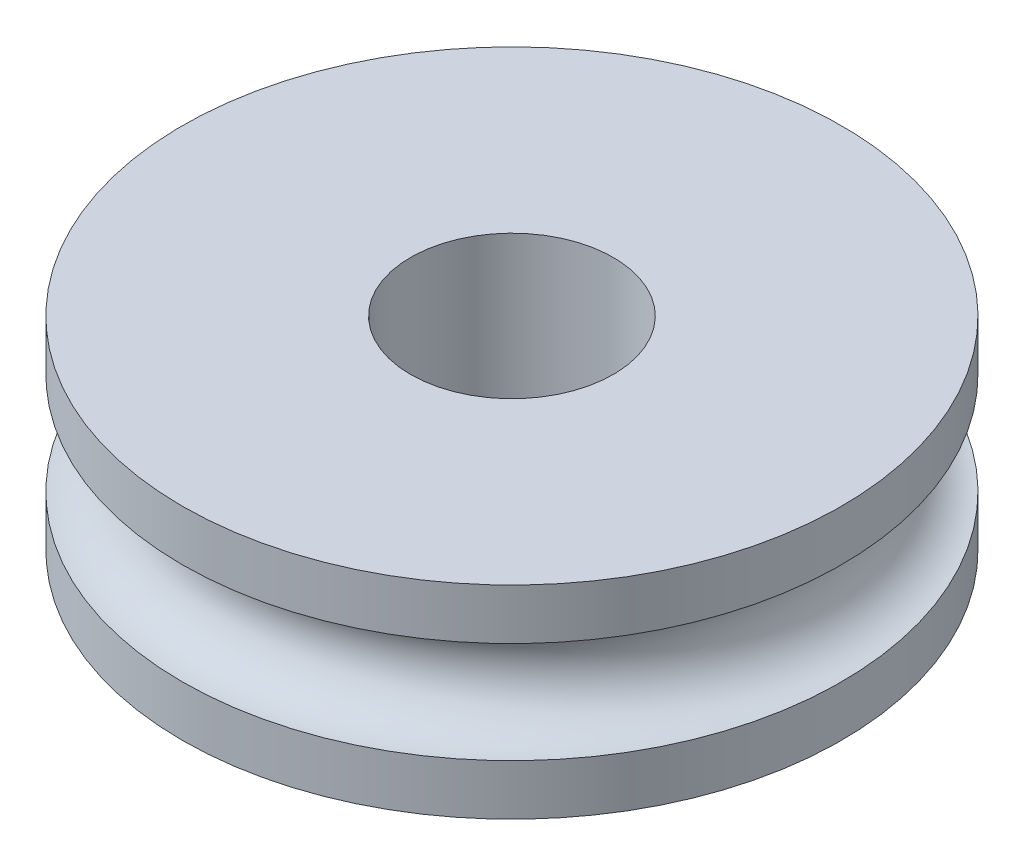
ISO-10303-21;
HEADER;
FILE_DESCRIPTION(('STEP AP214'),'2;1');
FILE_NAME('part.step','',(''),(''),'','','');
FILE_SCHEMA(('AUTOMOTIVE_DESIGN { 1 0 10303 214 1 1 1 1 }'));
ENDSEC;
DATA;
#1=APPLICATION_CONTEXT('core data for automotive mechanical design processes');
#2=APPLICATION_PROTOCOL_DEFINITION('international standard','automotive_design',2000,#1);
#3=PRODUCT_CONTEXT('',#1,'mechanical');
#4=PRODUCT('Part','Part','',(#3));
#5=PRODUCT_RELATED_PRODUCT_CATEGORY('part','',(#4));
#6=PRODUCT_DEFINITION_FORMATION('','',#4);
#7=PRODUCT_DEFINITION_CONTEXT('part definition',#1,'design');
#8=PRODUCT_DEFINITION('design','',#6,#7);
#9=PRODUCT_DEFINITION_SHAPE('','',#8);
#10=(LENGTH_UNIT() NAMED_UNIT(*) SI_UNIT(.MILLI.,.METRE.));
#11=(NAMED_UNIT(*) PLANE_ANGLE_UNIT() SI_UNIT($,.RADIAN.));
#12=(NAMED_UNIT(*) SI_UNIT($,.STERADIAN.) SOLID_ANGLE_UNIT());
#13=UNCERTAINTY_MEASURE_WITH_UNIT(LENGTH_MEASURE(1.E-05),#10,'distance_accuracy_value','');
#14=(GEOMETRIC_REPRESENTATION_CONTEXT(3) GLOBAL_UNCERTAINTY_ASSIGNED_CONTEXT((#13)) GLOBAL_UNIT_ASSIGNED_CONTEXT((#10,
#11,#12)) REPRESENTATION_CONTEXT('',''));
#15=CARTESIAN_POINT('',(0.,0.,0.));
#16=DIRECTION('',(0.,0.,1.));
#17=DIRECTION('',(1.,0.,0.));
#18=AXIS2_PLACEMENT_3D('',#15,#16,#17);
#19=CARTESIAN_POINT('',(6.5,2.,0.));
#20=DIRECTION('',(0.,-1.,0.));
#21=DIRECTION('',(0.,0.,-1.));
#22=AXIS2_PLACEMENT_3D('',#19,#20,#21);
#23=PLANE('',#22);
#24=CARTESIAN_POINT('',(0.,2.,0.));
#25=DIRECTION('',(0.,1.,0.));
#26=DIRECTION('',(0.,0.,1.));
#27=AXIS2_PLACEMENT_3D('',#24,#25,#26);
#28=CIRCLE('',#27,2.);
#29=CARTESIAN_POINT('',(0.,2.,2.));
#30=VERTEX_POINT('',#29);
#31=EDGE_CURVE('E58',#30,#30,#28,.T.);
#32=ORIENTED_EDGE('',*,*,#31,.F.);
#33=EDGE_LOOP('',(#32));
#34=FACE_BOUND('',#33,.T.);
#35=CARTESIAN_POINT('',(0.,2.,0.));
#36=DIRECTION('',(0.,1.,0.));
#37=DIRECTION('',(0.,0.,1.));
#38=AXIS2_PLACEMENT_3D('',#35,#36,#37);
#39=CIRCLE('',#38,6.5);
#40=CARTESIAN_POINT('',(0.,2.,6.5));
#41=VERTEX_POINT('',#40);
#42=EDGE_CURVE('E10',#41,#41,#39,.T.);
#43=ORIENTED_EDGE('',*,*,#42,.T.);
#44=EDGE_LOOP('',(#43));
#45=FACE_BOUND('',#44,.T.);
#46=ADVANCED_FACE('F35',(#34,#45),#23,.F.);
#47=CARTESIAN_POINT('',(0.,2.,0.));
#48=DIRECTION('',(0.,1.,0.));
#49=DIRECTION('',(0.,0.,1.));
#50=AXIS2_PLACEMENT_3D('',#47,#48,#49);
#51=CYLINDRICAL_SURFACE('',#50,6.5);
#52=ORIENTED_EDGE('',*,*,#42,.F.);
#53=EDGE_LOOP('',(#52));
#54=FACE_BOUND('',#53,.T.);
#55=CARTESIAN_POINT('',(0.,1.,0.));
#56=DIRECTION('',(0.,1.,0.));
#57=DIRECTION('',(0.,0.,1.));
#58=AXIS2_PLACEMENT_3D('',#55,#56,#57);
#59=CIRCLE('',#58,6.5);
#60=CARTESIAN_POINT('',(0.,1.,6.5));
#61=VERTEX_POINT('',#60);
#62=EDGE_CURVE('E42',#61,#61,#59,.T.);
#63=ORIENTED_EDGE('',*,*,#62,.T.);
#64=EDGE_LOOP('',(#63));
#65=FACE_BOUND('',#64,.T.);
#66=ADVANCED_FACE('F65',(#54,#65),#51,.T.);
#67=CARTESIAN_POINT('',(0.,0.,0.));
#68=DIRECTION('',(0.,1.,0.));
#69=DIRECTION('',(0.,0.,1.));
#70=AXIS2_PLACEMENT_3D('',#67,#68,#69);
#71=TOROIDAL_SURFACE('',#70,6.5,1.);
#72=ORIENTED_EDGE('',*,*,#62,.F.);
#73=EDGE_LOOP('',(#72));
#74=FACE_BOUND('',#73,.T.);
#75=CARTESIAN_POINT('',(0.,-1.,0.));
#76=DIRECTION('',(0.,1.,0.));
#77=DIRECTION('',(0.,0.,1.));
#78=AXIS2_PLACEMENT_3D('',#75,#76,#77);
#79=CIRCLE('',#78,6.5);
#80=CARTESIAN_POINT('',(0.,-1.,6.5));
#81=VERTEX_POINT('',#80);
#82=EDGE_CURVE('E46',#81,#81,#79,.T.);
#83=ORIENTED_EDGE('',*,*,#82,.T.);
#84=EDGE_LOOP('',(#83));
#85=FACE_BOUND('',#84,.T.);
#86=ADVANCED_FACE('F69',(#74,#85),#71,.F.);
#87=CARTESIAN_POINT('',(0.,2.,0.));
#88=DIRECTION('',(0.,1.,0.));
#89=DIRECTION('',(0.,0.,1.));
#90=AXIS2_PLACEMENT_3D('',#87,#88,#89);
#91=CYLINDRICAL_SURFACE('',#90,6.5);
#92=ORIENTED_EDGE('',*,*,#82,.F.);
#93=EDGE_LOOP('',(#92));
#94=FACE_BOUND('',#93,.T.);
#95=CARTESIAN_POINT('',(0.,-2.,0.));
#96=DIRECTION('',(0.,1.,0.));
#97=DIRECTION('',(0.,0.,1.));
#98=AXIS2_PLACEMENT_3D('',#95,#96,#97);
#99=CIRCLE('',#98,6.5);
#100=CARTESIAN_POINT('',(0.,-2.,6.5));
#101=VERTEX_POINT('',#100);
#102=EDGE_CURVE('E50',#101,#101,#99,.T.);
#103=ORIENTED_EDGE('',*,*,#102,.T.);
#104=EDGE_LOOP('',(#103));
#105=FACE_BOUND('',#104,.T.);
#106=ADVANCED_FACE('F74',(#94,#105),#91,.T.);
#107=CARTESIAN_POINT('',(2.,-2.,0.));
#108=DIRECTION('',(0.,1.,0.));
#109=DIRECTION('',(0.,0.,1.));
#110=AXIS2_PLACEMENT_3D('',#107,#108,#109);
#111=PLANE('',#110);
#112=ORIENTED_EDGE('',*,*,#102,.F.);
#113=EDGE_LOOP('',(#112));
#114=FACE_BOUND('',#113,.T.);
#115=CARTESIAN_POINT('',(0.,-2.,0.));
#116=DIRECTION('',(0.,1.,0.));
#117=DIRECTION('',(0.,0.,1.));
#118=AXIS2_PLACEMENT_3D('',#115,#116,#117);
#119=CIRCLE('',#118,2.);
#120=CARTESIAN_POINT('',(0.,-2.,2.));
#121=VERTEX_POINT('',#120);
#122=EDGE_CURVE('E55',#121,#121,#119,.T.);
#123=ORIENTED_EDGE('',*,*,#122,.T.);
#124=EDGE_LOOP('',(#123));
#125=FACE_BOUND('',#124,.T.);
#126=ADVANCED_FACE('F80',(#114,#125),#111,.F.);
#127=CARTESIAN_POINT('',(0.,2.,0.));
#128=DIRECTION('',(0.,1.,0.));
#129=DIRECTION('',(0.,0.,1.));
#130=AXIS2_PLACEMENT_3D('',#127,#128,#129);
#131=CYLINDRICAL_SURFACE('',#130,2.);
#132=ORIENTED_EDGE('',*,*,#122,.F.);
#133=EDGE_LOOP('',(#132));
#134=FACE_BOUND('',#133,.T.);
#135=ORIENTED_EDGE('',*,*,#31,.T.);
#136=EDGE_LOOP('',(#135));
#137=FACE_BOUND('',#136,.T.);
#138=ADVANCED_FACE('F62',(#134,#137),#131,.F.);
#139=CLOSED_SHELL('',(#46,#66,#86,#106,#126,#138));
#140=MANIFOLD_SOLID_BREP('B2',#139);
#141=ADVANCED_BREP_SHAPE_REPRESENTATION('',(#18,#140),#14);
#142=SHAPE_DEFINITION_REPRESENTATION(#9,#141);
ENDSEC;
END-ISO-10303-21;
